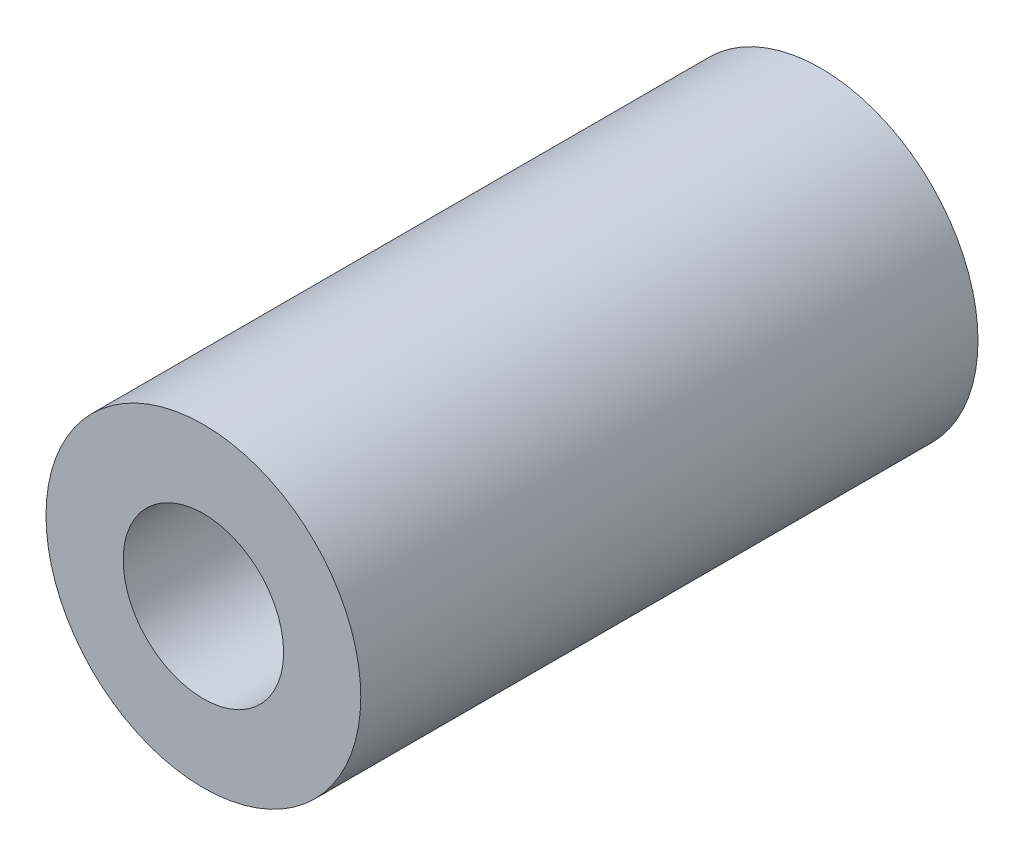
ISO-10303-21;
HEADER;
FILE_DESCRIPTION(('STEP AP214'),'2;1');
FILE_NAME('part.step','',(''),(''),'','','');
FILE_SCHEMA(('AUTOMOTIVE_DESIGN { 1 0 10303 214 1 1 1 1 }'));
ENDSEC;
DATA;
#1=APPLICATION_CONTEXT('core data for automotive mechanical design processes');
#2=APPLICATION_PROTOCOL_DEFINITION('international standard','automotive_design',2000,#1);
#3=PRODUCT_CONTEXT('',#1,'mechanical');
#4=PRODUCT('Part','Part','',(#3));
#5=PRODUCT_RELATED_PRODUCT_CATEGORY('part','',(#4));
#6=PRODUCT_DEFINITION_FORMATION('','',#4);
#7=PRODUCT_DEFINITION_CONTEXT('part definition',#1,'design');
#8=PRODUCT_DEFINITION('design','',#6,#7);
#9=PRODUCT_DEFINITION_SHAPE('','',#8);
#10=(LENGTH_UNIT() NAMED_UNIT(*) SI_UNIT(.MILLI.,.METRE.));
#11=(NAMED_UNIT(*) PLANE_ANGLE_UNIT() SI_UNIT($,.RADIAN.));
#12=(NAMED_UNIT(*) SI_UNIT($,.STERADIAN.) SOLID_ANGLE_UNIT());
#13=UNCERTAINTY_MEASURE_WITH_UNIT(LENGTH_MEASURE(1.E-05),#10,'distance_accuracy_value','');
#14=(GEOMETRIC_REPRESENTATION_CONTEXT(3) GLOBAL_UNCERTAINTY_ASSIGNED_CONTEXT((#13)) GLOBAL_UNIT_ASSIGNED_CONTEXT((#10,
#11,#12)) REPRESENTATION_CONTEXT('',''));
#15=CARTESIAN_POINT('',(0.,0.,0.));
#16=DIRECTION('',(0.,0.,1.));
#17=DIRECTION('',(1.,0.,0.));
#18=AXIS2_PLACEMENT_3D('',#15,#16,#17);
#19=CARTESIAN_POINT('',(0.,0.,20.));
#20=DIRECTION('',(0.,0.,1.));
#21=DIRECTION('',(1.,0.,0.));
#22=AXIS2_PLACEMENT_3D('',#19,#20,#21);
#23=PLANE('',#22);
#24=CARTESIAN_POINT('',(0.,0.,20.));
#25=DIRECTION('',(0.,0.,1.));
#26=DIRECTION('',(1.,0.,0.));
#27=AXIS2_PLACEMENT_3D('',#24,#25,#26);
#28=CIRCLE('',#27,5.1);
#29=CARTESIAN_POINT('',(5.1,0.,20.));
#30=VERTEX_POINT('',#29);
#31=EDGE_CURVE('E10',#30,#30,#28,.T.);
#32=ORIENTED_EDGE('',*,*,#31,.T.);
#33=EDGE_LOOP('',(#32));
#34=FACE_BOUND('',#33,.T.);
#35=CARTESIAN_POINT('',(0.,0.,20.));
#36=DIRECTION('',(0.,0.,1.));
#37=DIRECTION('',(1.,0.,0.));
#38=AXIS2_PLACEMENT_3D('',#35,#36,#37);
#39=CIRCLE('',#38,2.6);
#40=CARTESIAN_POINT('',(2.6,0.,20.));
#41=VERTEX_POINT('',#40);
#42=EDGE_CURVE('E45',#41,#41,#39,.T.);
#43=ORIENTED_EDGE('',*,*,#42,.F.);
#44=EDGE_LOOP('',(#43));
#45=FACE_BOUND('',#44,.T.);
#46=ADVANCED_FACE('F34',(#34,#45),#23,.T.);
#47=CARTESIAN_POINT('',(0.,0.,0.));
#48=DIRECTION('',(0.,0.,1.));
#49=DIRECTION('',(1.,0.,0.));
#50=AXIS2_PLACEMENT_3D('',#47,#48,#49);
#51=PLANE('',#50);
#52=CARTESIAN_POINT('',(0.,0.,0.));
#53=DIRECTION('',(0.,0.,1.));
#54=DIRECTION('',(1.,0.,0.));
#55=AXIS2_PLACEMENT_3D('',#52,#53,#54);
#56=CIRCLE('',#55,5.1);
#57=CARTESIAN_POINT('',(5.1,0.,0.));
#58=VERTEX_POINT('',#57);
#59=EDGE_CURVE('E38',#58,#58,#56,.T.);
#60=ORIENTED_EDGE('',*,*,#59,.F.);
#61=EDGE_LOOP('',(#60));
#62=FACE_BOUND('',#61,.T.);
#63=CARTESIAN_POINT('',(0.,0.,0.));
#64=DIRECTION('',(0.,0.,1.));
#65=DIRECTION('',(1.,0.,0.));
#66=AXIS2_PLACEMENT_3D('',#63,#64,#65);
#67=CIRCLE('',#66,2.6);
#68=CARTESIAN_POINT('',(2.6,0.,0.));
#69=VERTEX_POINT('',#68);
#70=EDGE_CURVE('E47',#69,#69,#67,.T.);
#71=ORIENTED_EDGE('',*,*,#70,.T.);
#72=EDGE_LOOP('',(#71));
#73=FACE_BOUND('',#72,.T.);
#74=ADVANCED_FACE('F57',(#62,#73),#51,.F.);
#75=CARTESIAN_POINT('',(0.,0.,20.));
#76=DIRECTION('',(0.,0.,-1.));
#77=DIRECTION('',(-1.,0.,0.));
#78=AXIS2_PLACEMENT_3D('',#75,#76,#77);
#79=CYLINDRICAL_SURFACE('',#78,5.1);
#80=ORIENTED_EDGE('',*,*,#31,.F.);
#81=EDGE_LOOP('',(#80));
#82=FACE_BOUND('',#81,.T.);
#83=ORIENTED_EDGE('',*,*,#59,.T.);
#84=EDGE_LOOP('',(#83));
#85=FACE_BOUND('',#84,.T.);
#86=ADVANCED_FACE('F36',(#82,#85),#79,.T.);
#87=CARTESIAN_POINT('',(0.,0.,20.));
#88=DIRECTION('',(0.,0.,-1.));
#89=DIRECTION('',(-1.,0.,0.));
#90=AXIS2_PLACEMENT_3D('',#87,#88,#89);
#91=CYLINDRICAL_SURFACE('',#90,2.6);
#92=ORIENTED_EDGE('',*,*,#42,.T.);
#93=EDGE_LOOP('',(#92));
#94=FACE_BOUND('',#93,.T.);
#95=ORIENTED_EDGE('',*,*,#70,.F.);
#96=EDGE_LOOP('',(#95));
#97=FACE_BOUND('',#96,.T.);
#98=ADVANCED_FACE('F53',(#94,#97),#91,.F.);
#99=CLOSED_SHELL('',(#46,#74,#86,#98));
#100=MANIFOLD_SOLID_BREP('B2',#99);
#101=ADVANCED_BREP_SHAPE_REPRESENTATION('',(#18,#100),#14);
#102=SHAPE_DEFINITION_REPRESENTATION(#9,#101);
ENDSEC;
END-ISO-10303-21;
